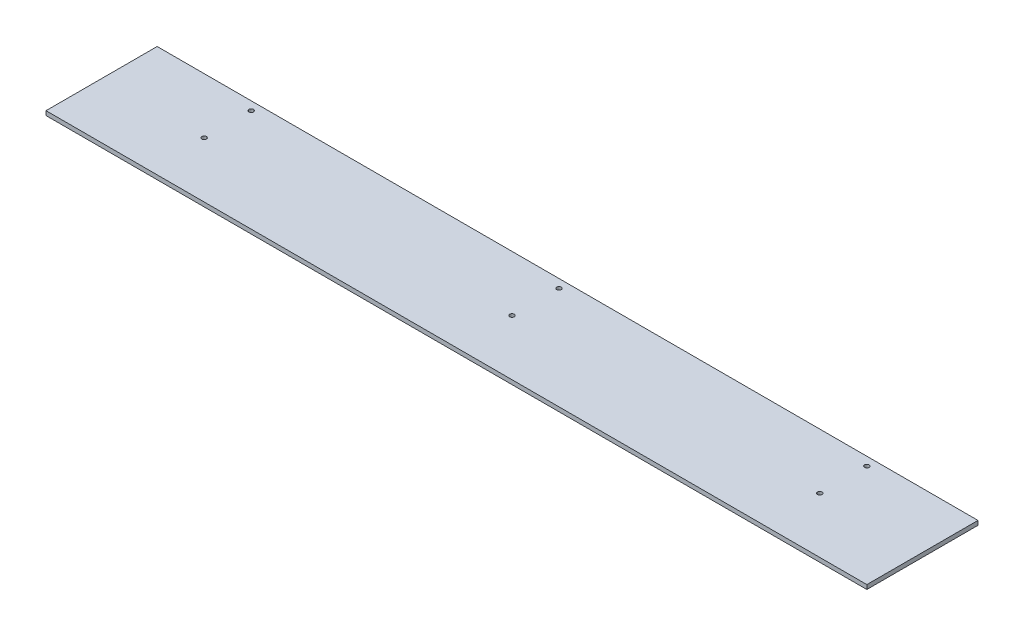
ISO-10303-21;
HEADER;
FILE_DESCRIPTION(('STEP AP214'),'2;1');
FILE_NAME('part.step','',(''),(''),'','','');
FILE_SCHEMA(('AUTOMOTIVE_DESIGN { 1 0 10303 214 1 1 1 1 }'));
ENDSEC;
DATA;
#1=APPLICATION_CONTEXT('core data for automotive mechanical design processes');
#2=APPLICATION_PROTOCOL_DEFINITION('international standard','automotive_design',2000,#1);
#3=PRODUCT_CONTEXT('',#1,'mechanical');
#4=PRODUCT('Part','Part','',(#3));
#5=PRODUCT_RELATED_PRODUCT_CATEGORY('part','',(#4));
#6=PRODUCT_DEFINITION_FORMATION('','',#4);
#7=PRODUCT_DEFINITION_CONTEXT('part definition',#1,'design');
#8=PRODUCT_DEFINITION('design','',#6,#7);
#9=PRODUCT_DEFINITION_SHAPE('','',#8);
#10=(LENGTH_UNIT() NAMED_UNIT(*) SI_UNIT(.MILLI.,.METRE.));
#11=(NAMED_UNIT(*) PLANE_ANGLE_UNIT() SI_UNIT($,.RADIAN.));
#12=(NAMED_UNIT(*) SI_UNIT($,.STERADIAN.) SOLID_ANGLE_UNIT());
#13=UNCERTAINTY_MEASURE_WITH_UNIT(LENGTH_MEASURE(1.E-05),#10,'distance_accuracy_value','');
#14=(GEOMETRIC_REPRESENTATION_CONTEXT(3) GLOBAL_UNCERTAINTY_ASSIGNED_CONTEXT((#13)) GLOBAL_UNIT_ASSIGNED_CONTEXT((#10,
#11,#12)) REPRESENTATION_CONTEXT('',''));
#15=CARTESIAN_POINT('',(0.,0.,0.));
#16=DIRECTION('',(0.,0.,1.));
#17=DIRECTION('',(1.,0.,0.));
#18=AXIS2_PLACEMENT_3D('',#15,#16,#17);
#19=CARTESIAN_POINT('',(609.6,-6.35,-1424.52631225586));
#20=DIRECTION('',(0.,0.,1.));
#21=DIRECTION('',(1.,0.,0.));
#22=AXIS2_PLACEMENT_3D('',#19,#20,#21);
#23=PLANE('',#22);
#24=DIRECTION('',(1.,0.,0.));
#25=VECTOR('',#24,1.);
#26=CARTESIAN_POINT('',(609.6,0.,-1424.52631225586));
#27=LINE('',#26,#25);
#28=CARTESIAN_POINT('',(0.,0.,-1424.52631225586));
#29=VERTEX_POINT('',#28);
#30=CARTESIAN_POINT('',(1219.2,0.,-1424.52631225586));
#31=VERTEX_POINT('',#30);
#32=EDGE_CURVE('E102',#29,#31,#27,.T.);
#33=ORIENTED_EDGE('',*,*,#32,.F.);
#34=DIRECTION('',(0.,1.,0.));
#35=VECTOR('',#34,1.);
#36=CARTESIAN_POINT('',(0.,-6.35,-1424.52631225586));
#37=LINE('',#36,#35);
#38=CARTESIAN_POINT('',(0.,-6.35,-1424.52631225586));
#39=VERTEX_POINT('',#38);
#40=EDGE_CURVE('E9',#39,#29,#37,.T.);
#41=ORIENTED_EDGE('',*,*,#40,.F.);
#42=DIRECTION('',(1.,0.,0.));
#43=VECTOR('',#42,1.);
#44=CARTESIAN_POINT('',(609.6,-6.35,-1424.52631225586));
#45=LINE('',#44,#43);
#46=CARTESIAN_POINT('',(1219.2,-6.35,-1424.52631225586));
#47=VERTEX_POINT('',#46);
#48=EDGE_CURVE('E79',#39,#47,#45,.T.);
#49=ORIENTED_EDGE('',*,*,#48,.T.);
#50=DIRECTION('',(0.,1.,0.));
#51=VECTOR('',#50,1.);
#52=CARTESIAN_POINT('',(1219.2,-6.35,-1424.52631225586));
#53=LINE('',#52,#51);
#54=EDGE_CURVE('E38',#47,#31,#53,.T.);
#55=ORIENTED_EDGE('',*,*,#54,.T.);
#56=EDGE_LOOP('',(#33,#41,#49,#55));
#57=FACE_BOUND('',#56,.T.);
#58=ADVANCED_FACE('F14',(#57),#23,.T.);
#59=CARTESIAN_POINT('',(0.,-6.35,-1507.07631225586));
#60=DIRECTION('',(1.,0.,0.));
#61=DIRECTION('',(0.,0.,-1.));
#62=AXIS2_PLACEMENT_3D('',#59,#60,#61);
#63=PLANE('',#62);
#64=DIRECTION('',(0.,0.,-1.));
#65=VECTOR('',#64,1.);
#66=CARTESIAN_POINT('',(0.,0.,-1507.07631225586));
#67=LINE('',#66,#65);
#68=CARTESIAN_POINT('',(0.,0.,-1589.62631225586));
#69=VERTEX_POINT('',#68);
#70=EDGE_CURVE('E86',#29,#69,#67,.T.);
#71=ORIENTED_EDGE('',*,*,#70,.T.);
#72=DIRECTION('',(0.,1.,0.));
#73=VECTOR('',#72,1.);
#74=CARTESIAN_POINT('',(0.,-6.35,-1589.62631225586));
#75=LINE('',#74,#73);
#76=CARTESIAN_POINT('',(0.,-6.35,-1589.62631225586));
#77=VERTEX_POINT('',#76);
#78=EDGE_CURVE('E24',#77,#69,#75,.T.);
#79=ORIENTED_EDGE('',*,*,#78,.F.);
#80=DIRECTION('',(0.,0.,-1.));
#81=VECTOR('',#80,1.);
#82=CARTESIAN_POINT('',(0.,-6.35,-1507.07631225586));
#83=LINE('',#82,#81);
#84=EDGE_CURVE('E73',#39,#77,#83,.T.);
#85=ORIENTED_EDGE('',*,*,#84,.F.);
#86=ORIENTED_EDGE('',*,*,#40,.T.);
#87=EDGE_LOOP('',(#71,#79,#85,#86));
#88=FACE_BOUND('',#87,.T.);
#89=ADVANCED_FACE('F84',(#88),#63,.F.);
#90=CARTESIAN_POINT('',(609.6,-6.35,-1589.62631225586));
#91=DIRECTION('',(0.,0.,1.));
#92=DIRECTION('',(1.,0.,0.));
#93=AXIS2_PLACEMENT_3D('',#90,#91,#92);
#94=PLANE('',#93);
#95=DIRECTION('',(1.,0.,0.));
#96=VECTOR('',#95,1.);
#97=CARTESIAN_POINT('',(609.6,0.,-1589.62631225586));
#98=LINE('',#97,#96);
#99=CARTESIAN_POINT('',(1219.2,0.,-1589.62631225586));
#100=VERTEX_POINT('',#99);
#101=EDGE_CURVE('E107',#69,#100,#98,.T.);
#102=ORIENTED_EDGE('',*,*,#101,.T.);
#103=DIRECTION('',(0.,1.,0.));
#104=VECTOR('',#103,1.);
#105=CARTESIAN_POINT('',(1219.2,-6.35,-1589.62631225586));
#106=LINE('',#105,#104);
#107=CARTESIAN_POINT('',(1219.2,-6.35,-1589.62631225586));
#108=VERTEX_POINT('',#107);
#109=EDGE_CURVE('E57',#108,#100,#106,.T.);
#110=ORIENTED_EDGE('',*,*,#109,.F.);
#111=DIRECTION('',(1.,0.,0.));
#112=VECTOR('',#111,1.);
#113=CARTESIAN_POINT('',(609.6,-6.35,-1589.62631225586));
#114=LINE('',#113,#112);
#115=EDGE_CURVE('E78',#77,#108,#114,.T.);
#116=ORIENTED_EDGE('',*,*,#115,.F.);
#117=ORIENTED_EDGE('',*,*,#78,.T.);
#118=EDGE_LOOP('',(#102,#110,#116,#117));
#119=FACE_BOUND('',#118,.T.);
#120=ADVANCED_FACE('F91',(#119),#94,.F.);
#121=CARTESIAN_POINT('',(1219.2,-6.35,-1507.07631225586));
#122=DIRECTION('',(1.,0.,0.));
#123=DIRECTION('',(0.,0.,-1.));
#124=AXIS2_PLACEMENT_3D('',#121,#122,#123);
#125=PLANE('',#124);
#126=DIRECTION('',(0.,0.,-1.));
#127=VECTOR('',#126,1.);
#128=CARTESIAN_POINT('',(1219.2,0.,-1507.07631225586));
#129=LINE('',#128,#127);
#130=EDGE_CURVE('E109',#31,#100,#129,.T.);
#131=ORIENTED_EDGE('',*,*,#130,.F.);
#132=ORIENTED_EDGE('',*,*,#54,.F.);
#133=DIRECTION('',(0.,0.,-1.));
#134=VECTOR('',#133,1.);
#135=CARTESIAN_POINT('',(1219.2,-6.35,-1507.07631225586));
#136=LINE('',#135,#134);
#137=EDGE_CURVE('E93',#47,#108,#136,.T.);
#138=ORIENTED_EDGE('',*,*,#137,.T.);
#139=ORIENTED_EDGE('',*,*,#109,.T.);
#140=EDGE_LOOP('',(#131,#132,#138,#139));
#141=FACE_BOUND('',#140,.T.);
#142=ADVANCED_FACE('F168',(#141),#125,.T.);
#143=CARTESIAN_POINT('',(609.6,-6.35,-1507.07631225586));
#144=DIRECTION('',(0.,-1.,0.));
#145=DIRECTION('',(1.,0.,0.));
#146=AXIS2_PLACEMENT_3D('',#143,#144,#145);
#147=PLANE('',#146);
#148=CARTESIAN_POINT('',(1066.8,-6.35000000000008,-1507.07631225586));
#149=DIRECTION('',(0.,-1.,0.));
#150=DIRECTION('',(0.,0.,-1.));
#151=AXIS2_PLACEMENT_3D('',#148,#149,#150);
#152=CIRCLE('',#151,3.36549999999991);
#153=CARTESIAN_POINT('',(1066.8,-6.35000000000008,-1510.44181225586));
#154=VERTEX_POINT('',#153);
#155=EDGE_CURVE('E155',#154,#154,#152,.T.);
#156=ORIENTED_EDGE('',*,*,#155,.F.);
#157=EDGE_LOOP('',(#156));
#158=FACE_BOUND('',#157,.T.);
#159=CARTESIAN_POINT('',(1066.8,-6.35000000000008,-1576.92631225586));
#160=DIRECTION('',(0.,-1.,0.));
#161=DIRECTION('',(0.,0.,-1.));
#162=AXIS2_PLACEMENT_3D('',#159,#160,#161);
#163=CIRCLE('',#162,3.36549999999991);
#164=CARTESIAN_POINT('',(1066.8,-6.35000000000008,-1580.29181225586));
#165=VERTEX_POINT('',#164);
#166=EDGE_CURVE('E138',#165,#165,#163,.T.);
#167=ORIENTED_EDGE('',*,*,#166,.F.);
#168=EDGE_LOOP('',(#167));
#169=FACE_BOUND('',#168,.T.);
#170=CARTESIAN_POINT('',(152.4,-6.35000000000008,-1576.92631225586));
#171=DIRECTION('',(0.,-1.,0.));
#172=DIRECTION('',(0.,0.,-1.));
#173=AXIS2_PLACEMENT_3D('',#170,#171,#172);
#174=CIRCLE('',#173,3.3655);
#175=CARTESIAN_POINT('',(152.4,-6.35000000000008,-1580.29181225586));
#176=VERTEX_POINT('',#175);
#177=EDGE_CURVE('E134',#176,#176,#174,.T.);
#178=ORIENTED_EDGE('',*,*,#177,.F.);
#179=EDGE_LOOP('',(#178));
#180=FACE_BOUND('',#179,.T.);
#181=CARTESIAN_POINT('',(152.4,-6.35000000000008,-1507.07631225586));
#182=DIRECTION('',(0.,-1.,0.));
#183=DIRECTION('',(0.,0.,-1.));
#184=AXIS2_PLACEMENT_3D('',#181,#182,#183);
#185=CIRCLE('',#184,3.3655);
#186=CARTESIAN_POINT('',(152.4,-6.35000000000008,-1510.44181225586));
#187=VERTEX_POINT('',#186);
#188=EDGE_CURVE('E130',#187,#187,#185,.T.);
#189=ORIENTED_EDGE('',*,*,#188,.F.);
#190=EDGE_LOOP('',(#189));
#191=FACE_BOUND('',#190,.T.);
#192=CARTESIAN_POINT('',(609.6,-6.35000000000008,-1576.92631225586));
#193=DIRECTION('',(0.,-1.,0.));
#194=DIRECTION('',(0.,0.,-1.));
#195=AXIS2_PLACEMENT_3D('',#192,#193,#194);
#196=CIRCLE('',#195,3.3655);
#197=CARTESIAN_POINT('',(609.6,-6.35000000000008,-1580.29181225586));
#198=VERTEX_POINT('',#197);
#199=EDGE_CURVE('E125',#198,#198,#196,.T.);
#200=ORIENTED_EDGE('',*,*,#199,.F.);
#201=EDGE_LOOP('',(#200));
#202=FACE_BOUND('',#201,.T.);
#203=CARTESIAN_POINT('',(609.6,-6.35000000000008,-1507.07631225586));
#204=DIRECTION('',(0.,-1.,0.));
#205=DIRECTION('',(0.,0.,-1.));
#206=AXIS2_PLACEMENT_3D('',#203,#204,#205);
#207=CIRCLE('',#206,3.3655);
#208=CARTESIAN_POINT('',(609.6,-6.35000000000008,-1510.44181225586));
#209=VERTEX_POINT('',#208);
#210=EDGE_CURVE('E120',#209,#209,#207,.T.);
#211=ORIENTED_EDGE('',*,*,#210,.F.);
#212=EDGE_LOOP('',(#211));
#213=FACE_BOUND('',#212,.T.);
#214=ORIENTED_EDGE('',*,*,#48,.F.);
#215=ORIENTED_EDGE('',*,*,#84,.T.);
#216=ORIENTED_EDGE('',*,*,#115,.T.);
#217=ORIENTED_EDGE('',*,*,#137,.F.);
#218=EDGE_LOOP('',(#214,#215,#216,#217));
#219=FACE_BOUND('',#218,.T.);
#220=ADVANCED_FACE('F75',(#158,#169,#180,#191,#202,#213,#219),#147,.T.);
#221=CARTESIAN_POINT('',(609.6,0.,-1507.07631225586));
#222=DIRECTION('',(0.,-1.,0.));
#223=DIRECTION('',(1.,0.,0.));
#224=AXIS2_PLACEMENT_3D('',#221,#222,#223);
#225=PLANE('',#224);
#226=CARTESIAN_POINT('',(1066.8,0.,-1507.07631225586));
#227=DIRECTION('',(0.,-1.,0.));
#228=DIRECTION('',(0.,0.,-1.));
#229=AXIS2_PLACEMENT_3D('',#226,#227,#228);
#230=CIRCLE('',#229,3.36549999999991);
#231=CARTESIAN_POINT('',(1066.8,0.,-1510.44181225586));
#232=VERTEX_POINT('',#231);
#233=EDGE_CURVE('E17',#232,#232,#230,.F.);
#234=ORIENTED_EDGE('',*,*,#233,.F.);
#235=EDGE_LOOP('',(#234));
#236=FACE_BOUND('',#235,.T.);
#237=CARTESIAN_POINT('',(1066.8,0.,-1576.92631225586));
#238=DIRECTION('',(0.,-1.,0.));
#239=DIRECTION('',(0.,0.,-1.));
#240=AXIS2_PLACEMENT_3D('',#237,#238,#239);
#241=CIRCLE('',#240,3.36549999999991);
#242=CARTESIAN_POINT('',(1066.8,0.,-1580.29181225586));
#243=VERTEX_POINT('',#242);
#244=EDGE_CURVE('E135',#243,#243,#241,.F.);
#245=ORIENTED_EDGE('',*,*,#244,.F.);
#246=EDGE_LOOP('',(#245));
#247=FACE_BOUND('',#246,.T.);
#248=CARTESIAN_POINT('',(152.4,0.,-1576.92631225586));
#249=DIRECTION('',(0.,-1.,0.));
#250=DIRECTION('',(0.,0.,-1.));
#251=AXIS2_PLACEMENT_3D('',#248,#249,#250);
#252=CIRCLE('',#251,3.3655);
#253=CARTESIAN_POINT('',(152.4,0.,-1580.29181225586));
#254=VERTEX_POINT('',#253);
#255=EDGE_CURVE('E131',#254,#254,#252,.F.);
#256=ORIENTED_EDGE('',*,*,#255,.F.);
#257=EDGE_LOOP('',(#256));
#258=FACE_BOUND('',#257,.T.);
#259=CARTESIAN_POINT('',(152.4,0.,-1507.07631225586));
#260=DIRECTION('',(0.,-1.,0.));
#261=DIRECTION('',(0.,0.,-1.));
#262=AXIS2_PLACEMENT_3D('',#259,#260,#261);
#263=CIRCLE('',#262,3.3655);
#264=CARTESIAN_POINT('',(152.4,0.,-1510.44181225586));
#265=VERTEX_POINT('',#264);
#266=EDGE_CURVE('E126',#265,#265,#263,.F.);
#267=ORIENTED_EDGE('',*,*,#266,.F.);
#268=EDGE_LOOP('',(#267));
#269=FACE_BOUND('',#268,.T.);
#270=CARTESIAN_POINT('',(609.6,0.,-1576.92631225586));
#271=DIRECTION('',(0.,-1.,0.));
#272=DIRECTION('',(0.,0.,-1.));
#273=AXIS2_PLACEMENT_3D('',#270,#271,#272);
#274=CIRCLE('',#273,3.3655);
#275=CARTESIAN_POINT('',(609.6,0.,-1580.29181225586));
#276=VERTEX_POINT('',#275);
#277=EDGE_CURVE('E121',#276,#276,#274,.F.);
#278=ORIENTED_EDGE('',*,*,#277,.F.);
#279=EDGE_LOOP('',(#278));
#280=FACE_BOUND('',#279,.T.);
#281=CARTESIAN_POINT('',(609.6,0.,-1507.07631225586));
#282=DIRECTION('',(0.,-1.,0.));
#283=DIRECTION('',(0.,0.,-1.));
#284=AXIS2_PLACEMENT_3D('',#281,#282,#283);
#285=CIRCLE('',#284,3.3655);
#286=CARTESIAN_POINT('',(609.6,0.,-1510.44181225586));
#287=VERTEX_POINT('',#286);
#288=EDGE_CURVE('E105',#287,#287,#285,.F.);
#289=ORIENTED_EDGE('',*,*,#288,.F.);
#290=EDGE_LOOP('',(#289));
#291=FACE_BOUND('',#290,.T.);
#292=ORIENTED_EDGE('',*,*,#32,.T.);
#293=ORIENTED_EDGE('',*,*,#130,.T.);
#294=ORIENTED_EDGE('',*,*,#101,.F.);
#295=ORIENTED_EDGE('',*,*,#70,.F.);
#296=EDGE_LOOP('',(#292,#293,#294,#295));
#297=FACE_BOUND('',#296,.T.);
#298=ADVANCED_FACE('F176',(#236,#247,#258,#269,#280,#291,#297),#225,.F.);
#299=CARTESIAN_POINT('',(609.6,1225.005347797,-1507.07631225586));
#300=DIRECTION('',(0.,-1.,0.));
#301=DIRECTION('',(0.,0.,-1.));
#302=AXIS2_PLACEMENT_3D('',#299,#300,#301);
#303=CYLINDRICAL_SURFACE('',#302,3.3655);
#304=ORIENTED_EDGE('',*,*,#210,.T.);
#305=EDGE_LOOP('',(#304));
#306=FACE_BOUND('',#305,.T.);
#307=ORIENTED_EDGE('',*,*,#288,.T.);
#308=EDGE_LOOP('',(#307));
#309=FACE_BOUND('',#308,.T.);
#310=ADVANCED_FACE('F218',(#306,#309),#303,.F.);
#311=CARTESIAN_POINT('',(609.6,1225.005347797,-1576.92631225586));
#312=DIRECTION('',(0.,-1.,0.));
#313=DIRECTION('',(0.,0.,-1.));
#314=AXIS2_PLACEMENT_3D('',#311,#312,#313);
#315=CYLINDRICAL_SURFACE('',#314,3.3655);
#316=ORIENTED_EDGE('',*,*,#199,.T.);
#317=EDGE_LOOP('',(#316));
#318=FACE_BOUND('',#317,.T.);
#319=ORIENTED_EDGE('',*,*,#277,.T.);
#320=EDGE_LOOP('',(#319));
#321=FACE_BOUND('',#320,.T.);
#322=ADVANCED_FACE('F228',(#318,#321),#315,.F.);
#323=CARTESIAN_POINT('',(152.4,1225.005347797,-1507.07631225586));
#324=DIRECTION('',(0.,-1.,0.));
#325=DIRECTION('',(0.,0.,-1.));
#326=AXIS2_PLACEMENT_3D('',#323,#324,#325);
#327=CYLINDRICAL_SURFACE('',#326,3.3655);
#328=ORIENTED_EDGE('',*,*,#188,.T.);
#329=EDGE_LOOP('',(#328));
#330=FACE_BOUND('',#329,.T.);
#331=ORIENTED_EDGE('',*,*,#266,.T.);
#332=EDGE_LOOP('',(#331));
#333=FACE_BOUND('',#332,.T.);
#334=ADVANCED_FACE('F239',(#330,#333),#327,.F.);
#335=CARTESIAN_POINT('',(152.4,1225.005347797,-1576.92631225586));
#336=DIRECTION('',(0.,-1.,0.));
#337=DIRECTION('',(0.,0.,-1.));
#338=AXIS2_PLACEMENT_3D('',#335,#336,#337);
#339=CYLINDRICAL_SURFACE('',#338,3.3655);
#340=ORIENTED_EDGE('',*,*,#177,.T.);
#341=EDGE_LOOP('',(#340));
#342=FACE_BOUND('',#341,.T.);
#343=ORIENTED_EDGE('',*,*,#255,.T.);
#344=EDGE_LOOP('',(#343));
#345=FACE_BOUND('',#344,.T.);
#346=ADVANCED_FACE('F250',(#342,#345),#339,.F.);
#347=CARTESIAN_POINT('',(1066.8,1225.005347797,-1576.92631225586));
#348=DIRECTION('',(0.,-1.,0.));
#349=DIRECTION('',(0.,0.,-1.));
#350=AXIS2_PLACEMENT_3D('',#347,#348,#349);
#351=CYLINDRICAL_SURFACE('',#350,3.36549999999991);
#352=ORIENTED_EDGE('',*,*,#166,.T.);
#353=EDGE_LOOP('',(#352));
#354=FACE_BOUND('',#353,.T.);
#355=ORIENTED_EDGE('',*,*,#244,.T.);
#356=EDGE_LOOP('',(#355));
#357=FACE_BOUND('',#356,.T.);
#358=ADVANCED_FACE('F261',(#354,#357),#351,.F.);
#359=CARTESIAN_POINT('',(1066.8,1225.005347797,-1507.07631225586));
#360=DIRECTION('',(0.,-1.,0.));
#361=DIRECTION('',(0.,0.,-1.));
#362=AXIS2_PLACEMENT_3D('',#359,#360,#361);
#363=CYLINDRICAL_SURFACE('',#362,3.36549999999991);
#364=ORIENTED_EDGE('',*,*,#155,.T.);
#365=EDGE_LOOP('',(#364));
#366=FACE_BOUND('',#365,.T.);
#367=ORIENTED_EDGE('',*,*,#233,.T.);
#368=EDGE_LOOP('',(#367));
#369=FACE_BOUND('',#368,.T.);
#370=ADVANCED_FACE('F271',(#366,#369),#363,.F.);
#371=CLOSED_SHELL('',(#58,#89,#120,#142,#220,#298,#310,#322,#334,#346,#358,#370));
#372=MANIFOLD_SOLID_BREP('B1',#371);
#373=ADVANCED_BREP_SHAPE_REPRESENTATION('',(#18,#372),#14);
#374=SHAPE_DEFINITION_REPRESENTATION(#9,#373);
ENDSEC;
END-ISO-10303-21;
